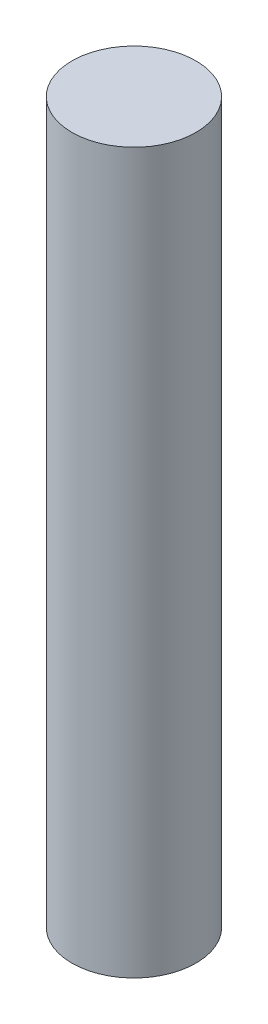
ISO-10303-21;
HEADER;
FILE_DESCRIPTION(('STEP AP214'),'2;1');
FILE_NAME('part.step','',(''),(''),'','','');
FILE_SCHEMA(('AUTOMOTIVE_DESIGN { 1 0 10303 214 1 1 1 1 }'));
ENDSEC;
DATA;
#1=APPLICATION_CONTEXT('core data for automotive mechanical design processes');
#2=APPLICATION_PROTOCOL_DEFINITION('international standard','automotive_design',2000,#1);
#3=PRODUCT_CONTEXT('',#1,'mechanical');
#4=PRODUCT('Part','Part','',(#3));
#5=PRODUCT_RELATED_PRODUCT_CATEGORY('part','',(#4));
#6=PRODUCT_DEFINITION_FORMATION('','',#4);
#7=PRODUCT_DEFINITION_CONTEXT('part definition',#1,'design');
#8=PRODUCT_DEFINITION('design','',#6,#7);
#9=PRODUCT_DEFINITION_SHAPE('','',#8);
#10=(LENGTH_UNIT() NAMED_UNIT(*) SI_UNIT(.MILLI.,.METRE.));
#11=(NAMED_UNIT(*) PLANE_ANGLE_UNIT() SI_UNIT($,.RADIAN.));
#12=(NAMED_UNIT(*) SI_UNIT($,.STERADIAN.) SOLID_ANGLE_UNIT());
#13=UNCERTAINTY_MEASURE_WITH_UNIT(LENGTH_MEASURE(1.E-05),#10,'distance_accuracy_value','');
#14=(GEOMETRIC_REPRESENTATION_CONTEXT(3) GLOBAL_UNCERTAINTY_ASSIGNED_CONTEXT((#13)) GLOBAL_UNIT_ASSIGNED_CONTEXT((#10,
#11,#12)) REPRESENTATION_CONTEXT('',''));
#15=CARTESIAN_POINT('',(0.,0.,0.));
#16=DIRECTION('',(0.,0.,1.));
#17=DIRECTION('',(1.,0.,0.));
#18=AXIS2_PLACEMENT_3D('',#15,#16,#17);
#19=CARTESIAN_POINT('',(0.,58.,0.));
#20=DIRECTION('',(0.,-1.,0.));
#21=DIRECTION('',(0.,0.,-1.));
#22=AXIS2_PLACEMENT_3D('',#19,#20,#21);
#23=CYLINDRICAL_SURFACE('',#22,5.);
#24=CARTESIAN_POINT('',(0.,58.,0.));
#25=DIRECTION('',(0.,1.,0.));
#26=DIRECTION('',(0.,0.,1.));
#27=AXIS2_PLACEMENT_3D('',#24,#25,#26);
#28=CIRCLE('',#27,5.);
#29=CARTESIAN_POINT('',(0.,58.,5.));
#30=VERTEX_POINT('',#29);
#31=EDGE_CURVE('E10',#30,#30,#28,.T.);
#32=ORIENTED_EDGE('',*,*,#31,.F.);
#33=EDGE_LOOP('',(#32));
#34=FACE_BOUND('',#33,.T.);
#35=CARTESIAN_POINT('',(0.,0.,0.));
#36=DIRECTION('',(0.,1.,0.));
#37=DIRECTION('',(0.,0.,1.));
#38=AXIS2_PLACEMENT_3D('',#35,#36,#37);
#39=CIRCLE('',#38,5.);
#40=CARTESIAN_POINT('',(0.,0.,5.));
#41=VERTEX_POINT('',#40);
#42=EDGE_CURVE('E44',#41,#41,#39,.T.);
#43=ORIENTED_EDGE('',*,*,#42,.T.);
#44=EDGE_LOOP('',(#43));
#45=FACE_BOUND('',#44,.T.);
#46=ADVANCED_FACE('F41',(#34,#45),#23,.T.);
#47=CARTESIAN_POINT('',(0.,58.,0.));
#48=DIRECTION('',(0.,1.,0.));
#49=DIRECTION('',(0.,0.,1.));
#50=AXIS2_PLACEMENT_3D('',#47,#48,#49);
#51=PLANE('',#50);
#52=ORIENTED_EDGE('',*,*,#31,.T.);
#53=EDGE_LOOP('',(#52));
#54=FACE_BOUND('',#53,.T.);
#55=ADVANCED_FACE('F58',(#54),#51,.T.);
#56=CARTESIAN_POINT('',(0.,0.,0.));
#57=DIRECTION('',(0.,1.,0.));
#58=DIRECTION('',(0.,0.,1.));
#59=AXIS2_PLACEMENT_3D('',#56,#57,#58);
#60=PLANE('',#59);
#61=ORIENTED_EDGE('',*,*,#42,.F.);
#62=EDGE_LOOP('',(#61));
#63=FACE_BOUND('',#62,.T.);
#64=ADVANCED_FACE('F56',(#63),#60,.F.);
#65=CLOSED_SHELL('',(#46,#55,#64));
#66=MANIFOLD_SOLID_BREP('B2',#65);
#67=ADVANCED_BREP_SHAPE_REPRESENTATION('',(#18,#66),#14);
#68=SHAPE_DEFINITION_REPRESENTATION(#9,#67);
ENDSEC;
END-ISO-10303-21;
